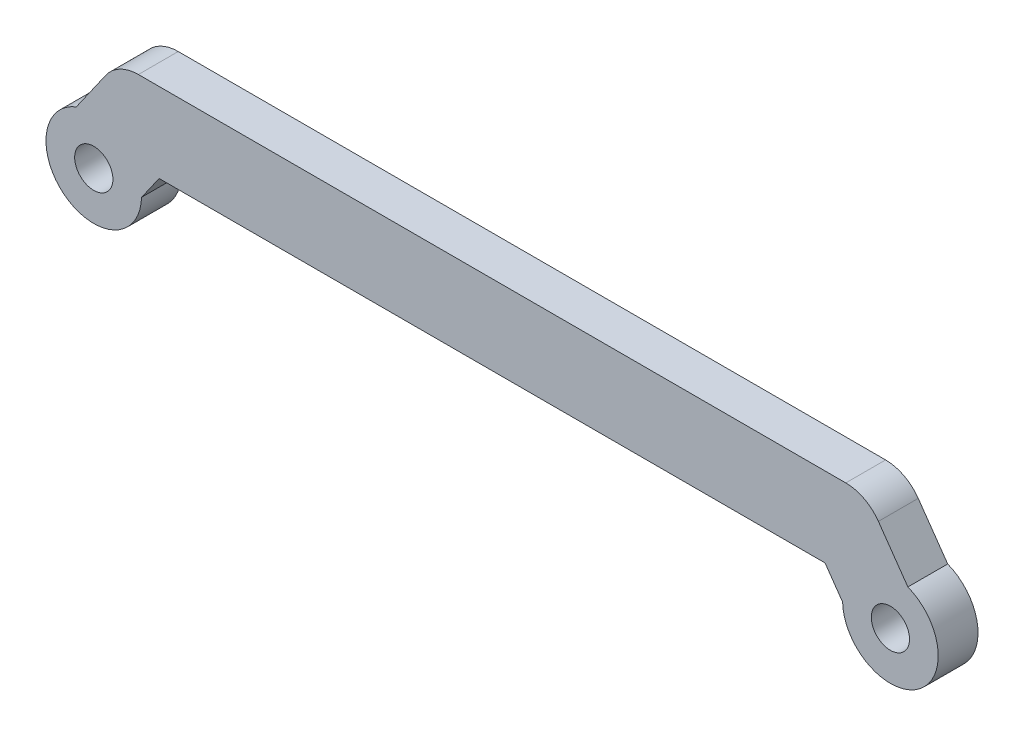
ISO-10303-21;
HEADER;
FILE_DESCRIPTION(('STEP AP214'),'2;1');
FILE_NAME('part.step','',(''),(''),'','','');
FILE_SCHEMA(('AUTOMOTIVE_DESIGN { 1 0 10303 214 1 1 1 1 }'));
ENDSEC;
DATA;
#1=APPLICATION_CONTEXT('core data for automotive mechanical design processes');
#2=APPLICATION_PROTOCOL_DEFINITION('international standard','automotive_design',2000,#1);
#3=PRODUCT_CONTEXT('',#1,'mechanical');
#4=PRODUCT('Part','Part','',(#3));
#5=PRODUCT_RELATED_PRODUCT_CATEGORY('part','',(#4));
#6=PRODUCT_DEFINITION_FORMATION('','',#4);
#7=PRODUCT_DEFINITION_CONTEXT('part definition',#1,'design');
#8=PRODUCT_DEFINITION('design','',#6,#7);
#9=PRODUCT_DEFINITION_SHAPE('','',#8);
#10=(LENGTH_UNIT() NAMED_UNIT(*) SI_UNIT(.MILLI.,.METRE.));
#11=(NAMED_UNIT(*) PLANE_ANGLE_UNIT() SI_UNIT($,.RADIAN.));
#12=(NAMED_UNIT(*) SI_UNIT($,.STERADIAN.) SOLID_ANGLE_UNIT());
#13=UNCERTAINTY_MEASURE_WITH_UNIT(LENGTH_MEASURE(1.E-05),#10,'distance_accuracy_value','');
#14=(GEOMETRIC_REPRESENTATION_CONTEXT(3) GLOBAL_UNCERTAINTY_ASSIGNED_CONTEXT((#13)) GLOBAL_UNIT_ASSIGNED_CONTEXT((#10,
#11,#12)) REPRESENTATION_CONTEXT('',''));
#15=CARTESIAN_POINT('',(0.,0.,0.));
#16=DIRECTION('',(0.,0.,1.));
#17=DIRECTION('',(1.,0.,0.));
#18=AXIS2_PLACEMENT_3D('',#15,#16,#17);
#19=CARTESIAN_POINT('',(14.7273716808485,10.3122166689462,1.25));
#20=DIRECTION('',(-0.819152044288993,-0.573576436351044,0.));
#21=DIRECTION('',(0.573576436351044,-0.819152044288993,0.));
#22=AXIS2_PLACEMENT_3D('',#19,#20,#21);
#23=PLANE('',#22);
#24=DIRECTION('',(0.,0.,-1.));
#25=VECTOR('',#24,1.);
#26=CARTESIAN_POINT('',(22.0009509752947,-0.0755311022979969,9.73528137423858));
#27=LINE('',#26,#25);
#28=CARTESIAN_POINT('',(22.0009509752947,-0.0755311022979976,1.25));
#29=VERTEX_POINT('',#28);
#30=CARTESIAN_POINT('',(22.0009509752947,-0.0755311022979976,-1.25));
#31=VERTEX_POINT('',#30);
#32=EDGE_CURVE('E119',#29,#31,#27,.T.);
#33=ORIENTED_EDGE('',*,*,#32,.F.);
#34=DIRECTION('',(-0.573576436351044,0.819152044288994,0.));
#35=VECTOR('',#34,1.);
#36=CARTESIAN_POINT('',(14.7273716808485,10.3122166689462,1.25));
#37=LINE('',#36,#35);
#38=CARTESIAN_POINT('',(20.8977522207818,1.5,1.25));
#39=VERTEX_POINT('',#38);
#40=EDGE_CURVE('E160',#29,#39,#37,.T.);
#41=ORIENTED_EDGE('',*,*,#40,.T.);
#42=DIRECTION('',(0.,0.,-1.));
#43=VECTOR('',#42,1.);
#44=CARTESIAN_POINT('',(20.8977522207818,1.5,1.25));
#45=LINE('',#44,#43);
#46=CARTESIAN_POINT('',(20.8977522207818,1.5,-1.25));
#47=VERTEX_POINT('',#46);
#48=EDGE_CURVE('E161',#39,#47,#45,.T.);
#49=ORIENTED_EDGE('',*,*,#48,.T.);
#50=DIRECTION('',(-0.573576436351044,0.819152044288994,0.));
#51=VECTOR('',#50,1.);
#52=CARTESIAN_POINT('',(14.7273716808485,10.3122166689462,-1.25));
#53=LINE('',#52,#51);
#54=EDGE_CURVE('E135',#31,#47,#53,.T.);
#55=ORIENTED_EDGE('',*,*,#54,.F.);
#56=EDGE_LOOP('',(#33,#41,#49,#55));
#57=FACE_BOUND('',#56,.T.);
#58=ADVANCED_FACE('F39',(#57),#23,.T.);
#59=CARTESIAN_POINT('',(18.8231319022935,13.1800988507014,1.25));
#60=DIRECTION('',(-0.819152044288995,-0.573576436351042,0.));
#61=DIRECTION('',(0.573576436351042,-0.819152044288995,0.));
#62=AXIS2_PLACEMENT_3D('',#59,#60,#61);
#63=PLANE('',#62);
#64=DIRECTION('',(-0.573576436351042,0.819152044288995,0.));
#65=VECTOR('',#64,1.);
#66=CARTESIAN_POINT('',(18.8231319022935,13.1800988507014,1.25));
#67=LINE('',#66,#65);
#68=CARTESIAN_POINT('',(26.0967111967397,2.79235107945721,1.25));
#69=VERTEX_POINT('',#68);
#70=CARTESIAN_POINT('',(24.2470499578837,5.43394109087761,1.25));
#71=VERTEX_POINT('',#70);
#72=EDGE_CURVE('E128',#69,#71,#67,.T.);
#73=ORIENTED_EDGE('',*,*,#72,.F.);
#74=DIRECTION('',(0.,0.,-1.));
#75=VECTOR('',#74,1.);
#76=CARTESIAN_POINT('',(26.0967111967397,2.79235107945721,9.73528137423858));
#77=LINE('',#76,#75);
#78=CARTESIAN_POINT('',(26.0967111967397,2.79235107945721,-1.25));
#79=VERTEX_POINT('',#78);
#80=EDGE_CURVE('E116',#69,#79,#77,.T.);
#81=ORIENTED_EDGE('',*,*,#80,.T.);
#82=DIRECTION('',(-0.573576436351042,0.819152044288995,0.));
#83=VECTOR('',#82,1.);
#84=CARTESIAN_POINT('',(18.8231319022935,13.1800988507014,-1.25));
#85=LINE('',#84,#83);
#86=CARTESIAN_POINT('',(24.2470499578837,5.43394109087761,-1.25));
#87=VERTEX_POINT('',#86);
#88=EDGE_CURVE('E127',#79,#87,#85,.T.);
#89=ORIENTED_EDGE('',*,*,#88,.T.);
#90=DIRECTION('',(0.,0.,-1.));
#91=VECTOR('',#90,1.);
#92=CARTESIAN_POINT('',(24.2470499578837,5.43394109087761,1.25));
#93=LINE('',#92,#91);
#94=EDGE_CURVE('E11',#71,#87,#93,.T.);
#95=ORIENTED_EDGE('',*,*,#94,.F.);
#96=EDGE_LOOP('',(#73,#81,#89,#95));
#97=FACE_BOUND('',#96,.T.);
#98=ADVANCED_FACE('F125',(#97),#63,.F.);
#99=CARTESIAN_POINT('',(22.1991698471612,4.,1.25));
#100=DIRECTION('',(0.,0.,-1.));
#101=DIRECTION('',(-1.,0.,0.));
#102=AXIS2_PLACEMENT_3D('',#99,#100,#101);
#103=CYLINDRICAL_SURFACE('',#102,2.5);
#104=CARTESIAN_POINT('',(22.1991698471612,4.,-1.25));
#105=DIRECTION('',(0.,0.,1.));
#106=DIRECTION('',(1.,0.,0.));
#107=AXIS2_PLACEMENT_3D('',#104,#105,#106);
#108=CIRCLE('',#107,2.5);
#109=CARTESIAN_POINT('',(22.1991698471612,6.5,-1.25));
#110=VERTEX_POINT('',#109);
#111=EDGE_CURVE('E134',#87,#110,#108,.T.);
#112=ORIENTED_EDGE('',*,*,#111,.T.);
#113=DIRECTION('',(0.,0.,-1.));
#114=VECTOR('',#113,1.);
#115=CARTESIAN_POINT('',(22.1991698471612,6.5,1.25));
#116=LINE('',#115,#114);
#117=CARTESIAN_POINT('',(22.1991698471612,6.5,1.25));
#118=VERTEX_POINT('',#117);
#119=EDGE_CURVE('E46',#118,#110,#116,.T.);
#120=ORIENTED_EDGE('',*,*,#119,.F.);
#121=CARTESIAN_POINT('',(22.1991698471612,4.,1.25));
#122=DIRECTION('',(0.,0.,1.));
#123=DIRECTION('',(1.,0.,0.));
#124=AXIS2_PLACEMENT_3D('',#121,#122,#123);
#125=CIRCLE('',#124,2.5);
#126=EDGE_CURVE('E195',#71,#118,#125,.T.);
#127=ORIENTED_EDGE('',*,*,#126,.F.);
#128=ORIENTED_EDGE('',*,*,#94,.T.);
#129=EDGE_LOOP('',(#112,#120,#127,#128));
#130=FACE_BOUND('',#129,.T.);
#131=ADVANCED_FACE('F239',(#130),#103,.T.);
#132=CARTESIAN_POINT('',(0.,6.5,1.25));
#133=DIRECTION('',(0.,-1.,0.));
#134=DIRECTION('',(1.,0.,0.));
#135=AXIS2_PLACEMENT_3D('',#132,#133,#134);
#136=PLANE('',#135);
#137=DIRECTION('',(-1.,0.,0.));
#138=VECTOR('',#137,1.);
#139=CARTESIAN_POINT('',(0.,6.5,-1.25));
#140=LINE('',#139,#138);
#141=CARTESIAN_POINT('',(-22.1991698471612,6.5,-1.25));
#142=VERTEX_POINT('',#141);
#143=EDGE_CURVE('E137',#110,#142,#140,.T.);
#144=ORIENTED_EDGE('',*,*,#143,.T.);
#145=DIRECTION('',(0.,0.,-1.));
#146=VECTOR('',#145,1.);
#147=CARTESIAN_POINT('',(-22.1991698471612,6.5,1.25));
#148=LINE('',#147,#146);
#149=CARTESIAN_POINT('',(-22.1991698471612,6.5,1.25));
#150=VERTEX_POINT('',#149);
#151=EDGE_CURVE('E171',#150,#142,#148,.T.);
#152=ORIENTED_EDGE('',*,*,#151,.F.);
#153=DIRECTION('',(-1.,0.,0.));
#154=VECTOR('',#153,1.);
#155=CARTESIAN_POINT('',(0.,6.5,1.25));
#156=LINE('',#155,#154);
#157=EDGE_CURVE('E179',#118,#150,#156,.T.);
#158=ORIENTED_EDGE('',*,*,#157,.F.);
#159=ORIENTED_EDGE('',*,*,#119,.T.);
#160=EDGE_LOOP('',(#144,#152,#158,#159));
#161=FACE_BOUND('',#160,.T.);
#162=ADVANCED_FACE('F177',(#161),#136,.F.);
#163=CARTESIAN_POINT('',(-22.1991698471612,3.99999999999999,1.25));
#164=DIRECTION('',(0.,0.,-1.));
#165=DIRECTION('',(-1.,0.,0.));
#166=AXIS2_PLACEMENT_3D('',#163,#164,#165);
#167=CYLINDRICAL_SURFACE('',#166,2.5);
#168=CARTESIAN_POINT('',(-22.1991698471612,3.99999999999999,-1.25));
#169=DIRECTION('',(0.,0.,1.));
#170=DIRECTION('',(1.,0.,0.));
#171=AXIS2_PLACEMENT_3D('',#168,#169,#170);
#172=CIRCLE('',#171,2.5);
#173=CARTESIAN_POINT('',(-24.2470499578837,5.43394109087761,-1.25));
#174=VERTEX_POINT('',#173);
#175=EDGE_CURVE('E144',#142,#174,#172,.T.);
#176=ORIENTED_EDGE('',*,*,#175,.T.);
#177=DIRECTION('',(0.,0.,-1.));
#178=VECTOR('',#177,1.);
#179=CARTESIAN_POINT('',(-24.2470499578837,5.43394109087761,1.25));
#180=LINE('',#179,#178);
#181=CARTESIAN_POINT('',(-24.2470499578837,5.43394109087761,1.25));
#182=VERTEX_POINT('',#181);
#183=EDGE_CURVE('E168',#182,#174,#180,.T.);
#184=ORIENTED_EDGE('',*,*,#183,.F.);
#185=CARTESIAN_POINT('',(-22.1991698471612,3.99999999999999,1.25));
#186=DIRECTION('',(0.,0.,1.));
#187=DIRECTION('',(1.,0.,0.));
#188=AXIS2_PLACEMENT_3D('',#185,#186,#187);
#189=CIRCLE('',#188,2.5);
#190=EDGE_CURVE('E190',#150,#182,#189,.T.);
#191=ORIENTED_EDGE('',*,*,#190,.F.);
#192=ORIENTED_EDGE('',*,*,#151,.T.);
#193=EDGE_LOOP('',(#176,#184,#191,#192));
#194=FACE_BOUND('',#193,.T.);
#195=ADVANCED_FACE('F187',(#194),#167,.T.);
#196=CARTESIAN_POINT('',(-18.8231319022935,13.1800988507014,1.25));
#197=DIRECTION('',(-0.819152044288995,0.573576436351042,0.));
#198=DIRECTION('',(-0.573576436351042,-0.819152044288995,0.));
#199=AXIS2_PLACEMENT_3D('',#196,#197,#198);
#200=PLANE('',#199);
#201=DIRECTION('',(0.,0.,-1.));
#202=VECTOR('',#201,1.);
#203=CARTESIAN_POINT('',(-26.0967111967397,2.7923510794572,9.73528137423858));
#204=LINE('',#203,#202);
#205=CARTESIAN_POINT('',(-26.0967111967397,2.7923510794572,1.25));
#206=VERTEX_POINT('',#205);
#207=CARTESIAN_POINT('',(-26.0967111967397,2.7923510794572,-1.25));
#208=VERTEX_POINT('',#207);
#209=EDGE_CURVE('E139',#206,#208,#204,.T.);
#210=ORIENTED_EDGE('',*,*,#209,.F.);
#211=DIRECTION('',(0.573576436351042,0.819152044288995,0.));
#212=VECTOR('',#211,1.);
#213=CARTESIAN_POINT('',(-18.8231319022935,13.1800988507014,1.25));
#214=LINE('',#213,#212);
#215=EDGE_CURVE('E191',#206,#182,#214,.T.);
#216=ORIENTED_EDGE('',*,*,#215,.T.);
#217=ORIENTED_EDGE('',*,*,#183,.T.);
#218=DIRECTION('',(0.573576436351042,0.819152044288995,0.));
#219=VECTOR('',#218,1.);
#220=CARTESIAN_POINT('',(-18.8231319022935,13.1800988507014,-1.25));
#221=LINE('',#220,#219);
#222=EDGE_CURVE('E147',#208,#174,#221,.T.);
#223=ORIENTED_EDGE('',*,*,#222,.F.);
#224=EDGE_LOOP('',(#210,#216,#217,#223));
#225=FACE_BOUND('',#224,.T.);
#226=ADVANCED_FACE('F256',(#225),#200,.T.);
#227=CARTESIAN_POINT('',(-14.7273716808484,10.3122166689462,1.25));
#228=DIRECTION('',(-0.819152044288993,0.573576436351044,0.));
#229=DIRECTION('',(-0.573576436351044,-0.819152044288993,0.));
#230=AXIS2_PLACEMENT_3D('',#227,#228,#229);
#231=PLANE('',#230);
#232=DIRECTION('',(0.573576436351044,0.819152044288993,0.));
#233=VECTOR('',#232,1.);
#234=CARTESIAN_POINT('',(-14.7273716808484,10.3122166689462,1.25));
#235=LINE('',#234,#233);
#236=CARTESIAN_POINT('',(-22.0009509752947,-0.0755311022980064,1.25));
#237=VERTEX_POINT('',#236);
#238=CARTESIAN_POINT('',(-20.8977522207818,1.5,1.25));
#239=VERTEX_POINT('',#238);
#240=EDGE_CURVE('E193',#237,#239,#235,.T.);
#241=ORIENTED_EDGE('',*,*,#240,.F.);
#242=DIRECTION('',(0.,0.,-1.));
#243=VECTOR('',#242,1.);
#244=CARTESIAN_POINT('',(-22.0009509752947,-0.0755311022980064,9.73528137423858));
#245=LINE('',#244,#243);
#246=CARTESIAN_POINT('',(-22.0009509752947,-0.0755311022980065,-1.25));
#247=VERTEX_POINT('',#246);
#248=EDGE_CURVE('E452',#237,#247,#245,.T.);
#249=ORIENTED_EDGE('',*,*,#248,.T.);
#250=DIRECTION('',(0.573576436351044,0.819152044288993,0.));
#251=VECTOR('',#250,1.);
#252=CARTESIAN_POINT('',(-14.7273716808484,10.3122166689462,-1.25));
#253=LINE('',#252,#251);
#254=CARTESIAN_POINT('',(-20.8977522207818,1.5,-1.25));
#255=VERTEX_POINT('',#254);
#256=EDGE_CURVE('E149',#247,#255,#253,.T.);
#257=ORIENTED_EDGE('',*,*,#256,.T.);
#258=DIRECTION('',(0.,0.,-1.));
#259=VECTOR('',#258,1.);
#260=CARTESIAN_POINT('',(-20.8977522207818,1.5,1.25));
#261=LINE('',#260,#259);
#262=EDGE_CURVE('E164',#239,#255,#261,.T.);
#263=ORIENTED_EDGE('',*,*,#262,.F.);
#264=EDGE_LOOP('',(#241,#249,#257,#263));
#265=FACE_BOUND('',#264,.T.);
#266=ADVANCED_FACE('F221',(#265),#231,.F.);
#267=CARTESIAN_POINT('',(25.,0.,1.25));
#268=DIRECTION('',(0.,0.,-1.));
#269=DIRECTION('',(-1.,0.,0.));
#270=AXIS2_PLACEMENT_3D('',#267,#268,#269);
#271=CYLINDRICAL_SURFACE('',#270,1.2);
#272=CARTESIAN_POINT('',(25.,0.,1.25));
#273=DIRECTION('',(0.,0.,1.));
#274=DIRECTION('',(1.,0.,0.));
#275=AXIS2_PLACEMENT_3D('',#272,#273,#274);
#276=CIRCLE('',#275,1.2);
#277=CARTESIAN_POINT('',(26.2,0.,1.25));
#278=VERTEX_POINT('',#277);
#279=EDGE_CURVE('E203',#278,#278,#276,.T.);
#280=ORIENTED_EDGE('',*,*,#279,.T.);
#281=EDGE_LOOP('',(#280));
#282=FACE_BOUND('',#281,.T.);
#283=CARTESIAN_POINT('',(25.,0.,-1.25));
#284=DIRECTION('',(0.,0.,1.));
#285=DIRECTION('',(1.,0.,0.));
#286=AXIS2_PLACEMENT_3D('',#283,#284,#285);
#287=CIRCLE('',#286,1.2);
#288=CARTESIAN_POINT('',(26.2,0.,-1.25));
#289=VERTEX_POINT('',#288);
#290=EDGE_CURVE('E154',#289,#289,#287,.T.);
#291=ORIENTED_EDGE('',*,*,#290,.F.);
#292=EDGE_LOOP('',(#291));
#293=FACE_BOUND('',#292,.T.);
#294=ADVANCED_FACE('F217',(#282,#293),#271,.F.);
#295=CARTESIAN_POINT('',(0.,1.5,1.25));
#296=DIRECTION('',(0.,-1.,0.));
#297=DIRECTION('',(1.,0.,0.));
#298=AXIS2_PLACEMENT_3D('',#295,#296,#297);
#299=PLANE('',#298);
#300=DIRECTION('',(-1.,0.,0.));
#301=VECTOR('',#300,1.);
#302=CARTESIAN_POINT('',(0.,1.5,-1.25));
#303=LINE('',#302,#301);
#304=EDGE_CURVE('E151',#47,#255,#303,.T.);
#305=ORIENTED_EDGE('',*,*,#304,.F.);
#306=ORIENTED_EDGE('',*,*,#48,.F.);
#307=DIRECTION('',(-1.,0.,0.));
#308=VECTOR('',#307,1.);
#309=CARTESIAN_POINT('',(0.,1.5,1.25));
#310=LINE('',#309,#308);
#311=EDGE_CURVE('E200',#39,#239,#310,.T.);
#312=ORIENTED_EDGE('',*,*,#311,.T.);
#313=ORIENTED_EDGE('',*,*,#262,.T.);
#314=EDGE_LOOP('',(#305,#306,#312,#313));
#315=FACE_BOUND('',#314,.T.);
#316=ADVANCED_FACE('F220',(#315),#299,.T.);
#317=CARTESIAN_POINT('',(-25.,0.,1.25));
#318=DIRECTION('',(0.,0.,-1.));
#319=DIRECTION('',(-1.,0.,0.));
#320=AXIS2_PLACEMENT_3D('',#317,#318,#319);
#321=CYLINDRICAL_SURFACE('',#320,1.2);
#322=CARTESIAN_POINT('',(-25.,0.,1.25));
#323=DIRECTION('',(0.,0.,1.));
#324=DIRECTION('',(1.,0.,0.));
#325=AXIS2_PLACEMENT_3D('',#322,#323,#324);
#326=CIRCLE('',#325,1.2);
#327=CARTESIAN_POINT('',(-23.8,0.,1.25));
#328=VERTEX_POINT('',#327);
#329=EDGE_CURVE('E165',#328,#328,#326,.T.);
#330=ORIENTED_EDGE('',*,*,#329,.T.);
#331=EDGE_LOOP('',(#330));
#332=FACE_BOUND('',#331,.T.);
#333=CARTESIAN_POINT('',(-25.,0.,-1.25));
#334=DIRECTION('',(0.,0.,1.));
#335=DIRECTION('',(1.,0.,0.));
#336=AXIS2_PLACEMENT_3D('',#333,#334,#335);
#337=CIRCLE('',#336,1.2);
#338=CARTESIAN_POINT('',(-23.8,0.,-1.25));
#339=VERTEX_POINT('',#338);
#340=EDGE_CURVE('E157',#339,#339,#337,.T.);
#341=ORIENTED_EDGE('',*,*,#340,.F.);
#342=EDGE_LOOP('',(#341));
#343=FACE_BOUND('',#342,.T.);
#344=ADVANCED_FACE('F208',(#332,#343),#321,.F.);
#345=CARTESIAN_POINT('',(0.,0.,1.25));
#346=DIRECTION('',(0.,0.,1.));
#347=DIRECTION('',(1.,0.,0.));
#348=AXIS2_PLACEMENT_3D('',#345,#346,#347);
#349=PLANE('',#348);
#350=ORIENTED_EDGE('',*,*,#40,.F.);
#351=CARTESIAN_POINT('',(25.,0.,1.25));
#352=DIRECTION('',(0.,0.,1.));
#353=DIRECTION('',(1.,0.,0.));
#354=AXIS2_PLACEMENT_3D('',#351,#352,#353);
#355=CIRCLE('',#354,3.);
#356=EDGE_CURVE('E53',#69,#29,#355,.F.);
#357=ORIENTED_EDGE('',*,*,#356,.F.);
#358=ORIENTED_EDGE('',*,*,#72,.T.);
#359=ORIENTED_EDGE('',*,*,#126,.T.);
#360=ORIENTED_EDGE('',*,*,#157,.T.);
#361=ORIENTED_EDGE('',*,*,#190,.T.);
#362=ORIENTED_EDGE('',*,*,#215,.F.);
#363=CARTESIAN_POINT('',(-25.,0.,1.25));
#364=DIRECTION('',(0.,0.,1.));
#365=DIRECTION('',(1.,0.,0.));
#366=AXIS2_PLACEMENT_3D('',#363,#364,#365);
#367=CIRCLE('',#366,3.);
#368=EDGE_CURVE('E60',#237,#206,#367,.F.);
#369=ORIENTED_EDGE('',*,*,#368,.F.);
#370=ORIENTED_EDGE('',*,*,#240,.T.);
#371=ORIENTED_EDGE('',*,*,#311,.F.);
#372=EDGE_LOOP('',(#350,#357,#358,#359,#360,#361,#362,#369,#370,#371));
#373=FACE_BOUND('',#372,.T.);
#374=ORIENTED_EDGE('',*,*,#329,.F.);
#375=EDGE_LOOP('',(#374));
#376=FACE_BOUND('',#375,.T.);
#377=ORIENTED_EDGE('',*,*,#279,.F.);
#378=EDGE_LOOP('',(#377));
#379=FACE_BOUND('',#378,.T.);
#380=ADVANCED_FACE('F211',(#373,#376,#379),#349,.T.);
#381=CARTESIAN_POINT('',(0.,0.,-1.25));
#382=DIRECTION('',(0.,0.,1.));
#383=DIRECTION('',(1.,0.,0.));
#384=AXIS2_PLACEMENT_3D('',#381,#382,#383);
#385=PLANE('',#384);
#386=CARTESIAN_POINT('',(25.,0.,-1.25));
#387=DIRECTION('',(0.,0.,-1.));
#388=DIRECTION('',(-1.,0.,0.));
#389=AXIS2_PLACEMENT_3D('',#386,#387,#388);
#390=CIRCLE('',#389,3.);
#391=EDGE_CURVE('E113',#79,#31,#390,.T.);
#392=ORIENTED_EDGE('',*,*,#391,.T.);
#393=ORIENTED_EDGE('',*,*,#54,.T.);
#394=ORIENTED_EDGE('',*,*,#304,.T.);
#395=ORIENTED_EDGE('',*,*,#256,.F.);
#396=CARTESIAN_POINT('',(-25.,0.,-1.25));
#397=DIRECTION('',(0.,0.,-1.));
#398=DIRECTION('',(-1.,0.,0.));
#399=AXIS2_PLACEMENT_3D('',#396,#397,#398);
#400=CIRCLE('',#399,3.);
#401=EDGE_CURVE('E449',#247,#208,#400,.T.);
#402=ORIENTED_EDGE('',*,*,#401,.T.);
#403=ORIENTED_EDGE('',*,*,#222,.T.);
#404=ORIENTED_EDGE('',*,*,#175,.F.);
#405=ORIENTED_EDGE('',*,*,#143,.F.);
#406=ORIENTED_EDGE('',*,*,#111,.F.);
#407=ORIENTED_EDGE('',*,*,#88,.F.);
#408=EDGE_LOOP('',(#392,#393,#394,#395,#402,#403,#404,#405,#406,#407));
#409=FACE_BOUND('',#408,.T.);
#410=ORIENTED_EDGE('',*,*,#340,.T.);
#411=EDGE_LOOP('',(#410));
#412=FACE_BOUND('',#411,.T.);
#413=ORIENTED_EDGE('',*,*,#290,.T.);
#414=EDGE_LOOP('',(#413));
#415=FACE_BOUND('',#414,.T.);
#416=ADVANCED_FACE('F131',(#409,#412,#415),#385,.F.);
#417=CARTESIAN_POINT('',(-25.,0.,9.73528137423858));
#418=DIRECTION('',(0.,0.,-1.));
#419=DIRECTION('',(-1.,0.,0.));
#420=AXIS2_PLACEMENT_3D('',#417,#418,#419);
#421=CYLINDRICAL_SURFACE('',#420,3.);
#422=ORIENTED_EDGE('',*,*,#368,.T.);
#423=ORIENTED_EDGE('',*,*,#209,.T.);
#424=ORIENTED_EDGE('',*,*,#401,.F.);
#425=ORIENTED_EDGE('',*,*,#248,.F.);
#426=EDGE_LOOP('',(#422,#423,#424,#425));
#427=FACE_BOUND('',#426,.T.);
#428=ADVANCED_FACE('F226',(#427),#421,.T.);
#429=CARTESIAN_POINT('',(25.,0.,9.73528137423858));
#430=DIRECTION('',(0.,0.,-1.));
#431=DIRECTION('',(-1.,0.,0.));
#432=AXIS2_PLACEMENT_3D('',#429,#430,#431);
#433=CYLINDRICAL_SURFACE('',#432,3.);
#434=ORIENTED_EDGE('',*,*,#356,.T.);
#435=ORIENTED_EDGE('',*,*,#32,.T.);
#436=ORIENTED_EDGE('',*,*,#391,.F.);
#437=ORIENTED_EDGE('',*,*,#80,.F.);
#438=EDGE_LOOP('',(#434,#435,#436,#437));
#439=FACE_BOUND('',#438,.T.);
#440=ADVANCED_FACE('F115',(#439),#433,.T.);
#441=CLOSED_SHELL('',(#58,#98,#131,#162,#195,#226,#266,#294,#316,#344,#380,#416,#428,#440));
#442=MANIFOLD_SOLID_BREP('B2',#441);
#443=ADVANCED_BREP_SHAPE_REPRESENTATION('',(#18,#442),#14);
#444=SHAPE_DEFINITION_REPRESENTATION(#9,#443);
ENDSEC;
END-ISO-10303-21;
